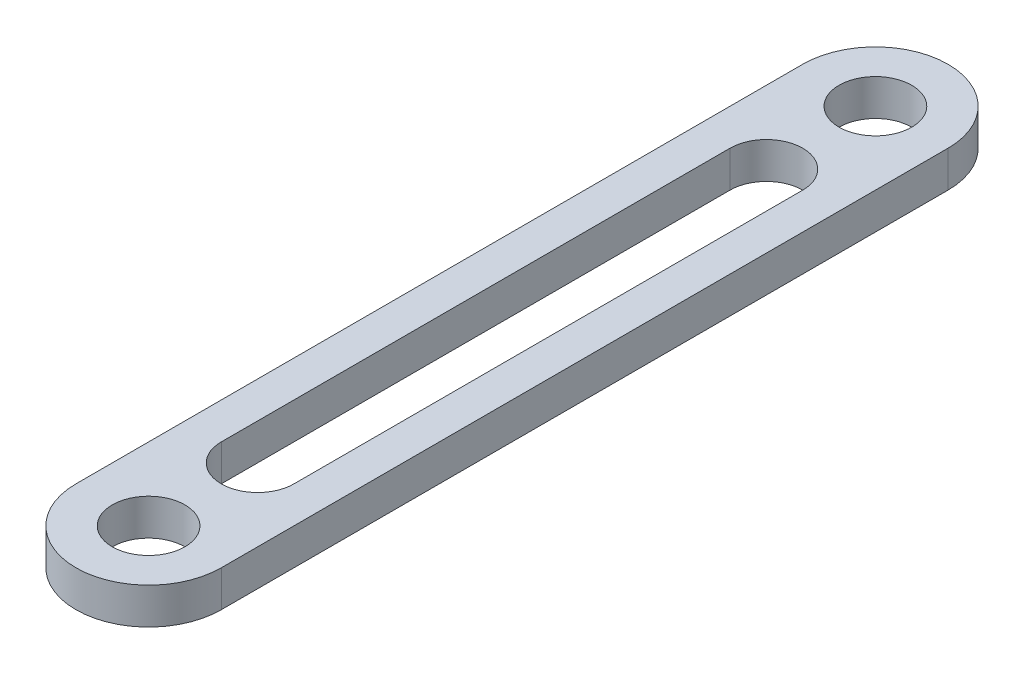
ISO-10303-21;
HEADER;
FILE_DESCRIPTION(('STEP AP214'),'2;1');
FILE_NAME('part.step','',(''),(''),'','','');
FILE_SCHEMA(('AUTOMOTIVE_DESIGN { 1 0 10303 214 1 1 1 1 }'));
ENDSEC;
DATA;
#1=APPLICATION_CONTEXT('core data for automotive mechanical design processes');
#2=APPLICATION_PROTOCOL_DEFINITION('international standard','automotive_design',2000,#1);
#3=PRODUCT_CONTEXT('',#1,'mechanical');
#4=PRODUCT('Part','Part','',(#3));
#5=PRODUCT_RELATED_PRODUCT_CATEGORY('part','',(#4));
#6=PRODUCT_DEFINITION_FORMATION('','',#4);
#7=PRODUCT_DEFINITION_CONTEXT('part definition',#1,'design');
#8=PRODUCT_DEFINITION('design','',#6,#7);
#9=PRODUCT_DEFINITION_SHAPE('','',#8);
#10=(LENGTH_UNIT() NAMED_UNIT(*) SI_UNIT(.MILLI.,.METRE.));
#11=(NAMED_UNIT(*) PLANE_ANGLE_UNIT() SI_UNIT($,.RADIAN.));
#12=(NAMED_UNIT(*) SI_UNIT($,.STERADIAN.) SOLID_ANGLE_UNIT());
#13=UNCERTAINTY_MEASURE_WITH_UNIT(LENGTH_MEASURE(1.E-05),#10,'distance_accuracy_value','');
#14=(GEOMETRIC_REPRESENTATION_CONTEXT(3) GLOBAL_UNCERTAINTY_ASSIGNED_CONTEXT((#13)) GLOBAL_UNIT_ASSIGNED_CONTEXT((#10,
#11,#12)) REPRESENTATION_CONTEXT('',''));
#15=CARTESIAN_POINT('',(0.,0.,0.));
#16=DIRECTION('',(0.,0.,1.));
#17=DIRECTION('',(1.,0.,0.));
#18=AXIS2_PLACEMENT_3D('',#15,#16,#17);
#19=CARTESIAN_POINT('',(0.,5.,0.));
#20=DIRECTION('',(0.,1.,0.));
#21=DIRECTION('',(0.,0.,1.));
#22=AXIS2_PLACEMENT_3D('',#19,#20,#21);
#23=PLANE('',#22);
#24=CARTESIAN_POINT('',(0.,5.,0.));
#25=DIRECTION('',(0.,1.,0.));
#26=DIRECTION('',(0.,0.,1.));
#27=AXIS2_PLACEMENT_3D('',#24,#25,#26);
#28=CIRCLE('',#27,5.);
#29=CARTESIAN_POINT('',(0.,5.,5.));
#30=VERTEX_POINT('',#29);
#31=EDGE_CURVE('E164',#30,#30,#28,.T.);
#32=ORIENTED_EDGE('',*,*,#31,.F.);
#33=EDGE_LOOP('',(#32));
#34=FACE_BOUND('',#33,.T.);
#35=CARTESIAN_POINT('',(0.,5.,0.));
#36=DIRECTION('',(0.,1.,0.));
#37=DIRECTION('',(0.,0.,1.));
#38=AXIS2_PLACEMENT_3D('',#35,#36,#37);
#39=CIRCLE('',#38,10.);
#40=CARTESIAN_POINT('',(-9.99999999999998,5.,0.));
#41=VERTEX_POINT('',#40);
#42=CARTESIAN_POINT('',(9.99999999999999,5.,0.));
#43=VERTEX_POINT('',#42);
#44=EDGE_CURVE('E172',#41,#43,#39,.T.);
#45=ORIENTED_EDGE('',*,*,#44,.T.);
#46=DIRECTION('',(0.,0.,-1.));
#47=VECTOR('',#46,1.);
#48=CARTESIAN_POINT('',(9.99999999999999,5.,0.));
#49=LINE('',#48,#47);
#50=CARTESIAN_POINT('',(10.,5.,-100.));
#51=VERTEX_POINT('',#50);
#52=EDGE_CURVE('E176',#43,#51,#49,.T.);
#53=ORIENTED_EDGE('',*,*,#52,.T.);
#54=CARTESIAN_POINT('',(0.,5.,-100.));
#55=DIRECTION('',(0.,1.,0.));
#56=DIRECTION('',(0.,0.,1.));
#57=AXIS2_PLACEMENT_3D('',#54,#55,#56);
#58=CIRCLE('',#57,10.);
#59=CARTESIAN_POINT('',(-9.99999999999999,5.,-100.));
#60=VERTEX_POINT('',#59);
#61=EDGE_CURVE('E180',#51,#60,#58,.T.);
#62=ORIENTED_EDGE('',*,*,#61,.T.);
#63=DIRECTION('',(0.,0.,1.));
#64=VECTOR('',#63,1.);
#65=CARTESIAN_POINT('',(-9.99999999999998,5.,0.));
#66=LINE('',#65,#64);
#67=EDGE_CURVE('E183',#60,#41,#66,.T.);
#68=ORIENTED_EDGE('',*,*,#67,.T.);
#69=EDGE_LOOP('',(#45,#53,#62,#68));
#70=FACE_BOUND('',#69,.T.);
#71=CARTESIAN_POINT('',(-3.46944695195361E-13,5.,-100.));
#72=DIRECTION('',(0.,1.,0.));
#73=DIRECTION('',(0.,0.,1.));
#74=AXIS2_PLACEMENT_3D('',#71,#72,#73);
#75=CIRCLE('',#74,5.);
#76=CARTESIAN_POINT('',(-3.46944695195361E-13,5.,-95.));
#77=VERTEX_POINT('',#76);
#78=EDGE_CURVE('E156',#77,#77,#75,.T.);
#79=ORIENTED_EDGE('',*,*,#78,.F.);
#80=EDGE_LOOP('',(#79));
#81=FACE_BOUND('',#80,.T.);
#82=DIRECTION('',(0.,0.,1.));
#83=VECTOR('',#82,1.);
#84=CARTESIAN_POINT('',(-4.99999999999999,5.,-85.));
#85=LINE('',#84,#83);
#86=CARTESIAN_POINT('',(-4.99999999999999,5.,-85.));
#87=VERTEX_POINT('',#86);
#88=CARTESIAN_POINT('',(-4.99999999999998,5.,-15.));
#89=VERTEX_POINT('',#88);
#90=EDGE_CURVE('E115',#87,#89,#85,.T.);
#91=ORIENTED_EDGE('',*,*,#90,.F.);
#92=CARTESIAN_POINT('',(0.,5.,-85.));
#93=DIRECTION('',(0.,1.,0.));
#94=DIRECTION('',(0.,0.,1.));
#95=AXIS2_PLACEMENT_3D('',#92,#93,#94);
#96=CIRCLE('',#95,4.99999999999999);
#97=CARTESIAN_POINT('',(4.99999999999998,5.,-85.));
#98=VERTEX_POINT('',#97);
#99=EDGE_CURVE('E106',#98,#87,#96,.T.);
#100=ORIENTED_EDGE('',*,*,#99,.F.);
#101=DIRECTION('',(0.,0.,-1.));
#102=VECTOR('',#101,1.);
#103=CARTESIAN_POINT('',(4.99999999999998,5.,-85.));
#104=LINE('',#103,#102);
#105=CARTESIAN_POINT('',(5.,5.,-15.));
#106=VERTEX_POINT('',#105);
#107=EDGE_CURVE('E134',#106,#98,#104,.T.);
#108=ORIENTED_EDGE('',*,*,#107,.F.);
#109=CARTESIAN_POINT('',(0.,5.,-15.));
#110=DIRECTION('',(0.,1.,0.));
#111=DIRECTION('',(0.,0.,1.));
#112=AXIS2_PLACEMENT_3D('',#109,#110,#111);
#113=CIRCLE('',#112,4.99999999999999);
#114=EDGE_CURVE('E128',#89,#106,#113,.T.);
#115=ORIENTED_EDGE('',*,*,#114,.F.);
#116=EDGE_LOOP('',(#91,#100,#108,#115));
#117=FACE_BOUND('',#116,.T.);
#118=ADVANCED_FACE('F40',(#34,#70,#81,#117),#23,.T.);
#119=CARTESIAN_POINT('',(0.,0.,0.));
#120=DIRECTION('',(0.,1.,0.));
#121=DIRECTION('',(0.,0.,1.));
#122=AXIS2_PLACEMENT_3D('',#119,#120,#121);
#123=PLANE('',#122);
#124=CARTESIAN_POINT('',(-3.46944695195361E-13,0.,-100.));
#125=DIRECTION('',(0.,1.,0.));
#126=DIRECTION('',(0.,0.,1.));
#127=AXIS2_PLACEMENT_3D('',#124,#125,#126);
#128=CIRCLE('',#127,5.);
#129=CARTESIAN_POINT('',(-3.46944695195361E-13,0.,-95.));
#130=VERTEX_POINT('',#129);
#131=EDGE_CURVE('E124',#130,#130,#128,.T.);
#132=ORIENTED_EDGE('',*,*,#131,.T.);
#133=EDGE_LOOP('',(#132));
#134=FACE_BOUND('',#133,.T.);
#135=CARTESIAN_POINT('',(0.,0.,0.));
#136=DIRECTION('',(0.,1.,0.));
#137=DIRECTION('',(0.,0.,1.));
#138=AXIS2_PLACEMENT_3D('',#135,#136,#137);
#139=CIRCLE('',#138,5.);
#140=CARTESIAN_POINT('',(0.,0.,5.));
#141=VERTEX_POINT('',#140);
#142=EDGE_CURVE('E160',#141,#141,#139,.T.);
#143=ORIENTED_EDGE('',*,*,#142,.T.);
#144=EDGE_LOOP('',(#143));
#145=FACE_BOUND('',#144,.T.);
#146=CARTESIAN_POINT('',(0.,0.,0.));
#147=DIRECTION('',(0.,1.,0.));
#148=DIRECTION('',(0.,0.,1.));
#149=AXIS2_PLACEMENT_3D('',#146,#147,#148);
#150=CIRCLE('',#149,10.);
#151=CARTESIAN_POINT('',(-9.99999999999998,0.,0.));
#152=VERTEX_POINT('',#151);
#153=CARTESIAN_POINT('',(9.99999999999999,0.,0.));
#154=VERTEX_POINT('',#153);
#155=EDGE_CURVE('E168',#152,#154,#150,.T.);
#156=ORIENTED_EDGE('',*,*,#155,.F.);
#157=DIRECTION('',(0.,0.,1.));
#158=VECTOR('',#157,1.);
#159=CARTESIAN_POINT('',(-9.99999999999998,0.,0.));
#160=LINE('',#159,#158);
#161=CARTESIAN_POINT('',(-9.99999999999999,0.,-100.));
#162=VERTEX_POINT('',#161);
#163=EDGE_CURVE('E177',#162,#152,#160,.T.);
#164=ORIENTED_EDGE('',*,*,#163,.F.);
#165=CARTESIAN_POINT('',(0.,0.,-100.));
#166=DIRECTION('',(0.,1.,0.));
#167=DIRECTION('',(0.,0.,1.));
#168=AXIS2_PLACEMENT_3D('',#165,#166,#167);
#169=CIRCLE('',#168,10.);
#170=CARTESIAN_POINT('',(10.,0.,-100.));
#171=VERTEX_POINT('',#170);
#172=EDGE_CURVE('E193',#171,#162,#169,.T.);
#173=ORIENTED_EDGE('',*,*,#172,.F.);
#174=DIRECTION('',(0.,0.,-1.));
#175=VECTOR('',#174,1.);
#176=CARTESIAN_POINT('',(9.99999999999999,0.,0.));
#177=LINE('',#176,#175);
#178=EDGE_CURVE('E190',#154,#171,#177,.T.);
#179=ORIENTED_EDGE('',*,*,#178,.F.);
#180=EDGE_LOOP('',(#156,#164,#173,#179));
#181=FACE_BOUND('',#180,.T.);
#182=CARTESIAN_POINT('',(0.,0.,-85.));
#183=DIRECTION('',(0.,1.,0.));
#184=DIRECTION('',(0.,0.,1.));
#185=AXIS2_PLACEMENT_3D('',#182,#183,#184);
#186=CIRCLE('',#185,4.99999999999999);
#187=CARTESIAN_POINT('',(4.99999999999998,0.,-85.));
#188=VERTEX_POINT('',#187);
#189=CARTESIAN_POINT('',(-4.99999999999999,0.,-85.));
#190=VERTEX_POINT('',#189);
#191=EDGE_CURVE('E64',#188,#190,#186,.T.);
#192=ORIENTED_EDGE('',*,*,#191,.T.);
#193=DIRECTION('',(0.,0.,1.));
#194=VECTOR('',#193,1.);
#195=CARTESIAN_POINT('',(-4.99999999999999,0.,-85.));
#196=LINE('',#195,#194);
#197=CARTESIAN_POINT('',(-4.99999999999998,0.,-15.));
#198=VERTEX_POINT('',#197);
#199=EDGE_CURVE('E122',#190,#198,#196,.T.);
#200=ORIENTED_EDGE('',*,*,#199,.T.);
#201=CARTESIAN_POINT('',(0.,0.,-15.));
#202=DIRECTION('',(0.,1.,0.));
#203=DIRECTION('',(0.,0.,1.));
#204=AXIS2_PLACEMENT_3D('',#201,#202,#203);
#205=CIRCLE('',#204,4.99999999999999);
#206=CARTESIAN_POINT('',(5.,0.,-15.));
#207=VERTEX_POINT('',#206);
#208=EDGE_CURVE('E143',#198,#207,#205,.T.);
#209=ORIENTED_EDGE('',*,*,#208,.T.);
#210=DIRECTION('',(0.,0.,-1.));
#211=VECTOR('',#210,1.);
#212=CARTESIAN_POINT('',(4.99999999999998,0.,-85.));
#213=LINE('',#212,#211);
#214=EDGE_CURVE('E116',#207,#188,#213,.T.);
#215=ORIENTED_EDGE('',*,*,#214,.T.);
#216=EDGE_LOOP('',(#192,#200,#209,#215));
#217=FACE_BOUND('',#216,.T.);
#218=ADVANCED_FACE('F218',(#134,#145,#181,#217),#123,.F.);
#219=CARTESIAN_POINT('',(0.,5.,0.));
#220=DIRECTION('',(0.,-1.,0.));
#221=DIRECTION('',(0.,0.,-1.));
#222=AXIS2_PLACEMENT_3D('',#219,#220,#221);
#223=CYLINDRICAL_SURFACE('',#222,10.);
#224=ORIENTED_EDGE('',*,*,#155,.T.);
#225=DIRECTION('',(0.,-1.,0.));
#226=VECTOR('',#225,1.);
#227=CARTESIAN_POINT('',(9.99999999999999,5.,0.));
#228=LINE('',#227,#226);
#229=EDGE_CURVE('E11',#43,#154,#228,.T.);
#230=ORIENTED_EDGE('',*,*,#229,.F.);
#231=ORIENTED_EDGE('',*,*,#44,.F.);
#232=DIRECTION('',(0.,-1.,0.));
#233=VECTOR('',#232,1.);
#234=CARTESIAN_POINT('',(-9.99999999999998,5.,0.));
#235=LINE('',#234,#233);
#236=EDGE_CURVE('E186',#41,#152,#235,.T.);
#237=ORIENTED_EDGE('',*,*,#236,.T.);
#238=EDGE_LOOP('',(#224,#230,#231,#237));
#239=FACE_BOUND('',#238,.T.);
#240=ADVANCED_FACE('F42',(#239),#223,.T.);
#241=CARTESIAN_POINT('',(9.99999999999999,5.,0.));
#242=DIRECTION('',(-1.,0.,0.));
#243=DIRECTION('',(0.,0.,1.));
#244=AXIS2_PLACEMENT_3D('',#241,#242,#243);
#245=PLANE('',#244);
#246=ORIENTED_EDGE('',*,*,#178,.T.);
#247=DIRECTION('',(0.,-1.,0.));
#248=VECTOR('',#247,1.);
#249=CARTESIAN_POINT('',(10.,5.,-100.));
#250=LINE('',#249,#248);
#251=EDGE_CURVE('E49',#51,#171,#250,.T.);
#252=ORIENTED_EDGE('',*,*,#251,.F.);
#253=ORIENTED_EDGE('',*,*,#52,.F.);
#254=ORIENTED_EDGE('',*,*,#229,.T.);
#255=EDGE_LOOP('',(#246,#252,#253,#254));
#256=FACE_BOUND('',#255,.T.);
#257=ADVANCED_FACE('F229',(#256),#245,.F.);
#258=CARTESIAN_POINT('',(0.,5.,-100.));
#259=DIRECTION('',(0.,-1.,0.));
#260=DIRECTION('',(0.,0.,-1.));
#261=AXIS2_PLACEMENT_3D('',#258,#259,#260);
#262=CYLINDRICAL_SURFACE('',#261,10.);
#263=ORIENTED_EDGE('',*,*,#172,.T.);
#264=DIRECTION('',(0.,-1.,0.));
#265=VECTOR('',#264,1.);
#266=CARTESIAN_POINT('',(-9.99999999999999,5.,-100.));
#267=LINE('',#266,#265);
#268=EDGE_CURVE('E201',#60,#162,#267,.T.);
#269=ORIENTED_EDGE('',*,*,#268,.F.);
#270=ORIENTED_EDGE('',*,*,#61,.F.);
#271=ORIENTED_EDGE('',*,*,#251,.T.);
#272=EDGE_LOOP('',(#263,#269,#270,#271));
#273=FACE_BOUND('',#272,.T.);
#274=ADVANCED_FACE('F212',(#273),#262,.T.);
#275=CARTESIAN_POINT('',(-9.99999999999998,5.,0.));
#276=DIRECTION('',(1.,0.,0.));
#277=DIRECTION('',(0.,0.,-1.));
#278=AXIS2_PLACEMENT_3D('',#275,#276,#277);
#279=PLANE('',#278);
#280=ORIENTED_EDGE('',*,*,#163,.T.);
#281=ORIENTED_EDGE('',*,*,#236,.F.);
#282=ORIENTED_EDGE('',*,*,#67,.F.);
#283=ORIENTED_EDGE('',*,*,#268,.T.);
#284=EDGE_LOOP('',(#280,#281,#282,#283));
#285=FACE_BOUND('',#284,.T.);
#286=ADVANCED_FACE('F222',(#285),#279,.F.);
#287=CARTESIAN_POINT('',(0.,5.,0.));
#288=DIRECTION('',(0.,-1.,0.));
#289=DIRECTION('',(0.,0.,-1.));
#290=AXIS2_PLACEMENT_3D('',#287,#288,#289);
#291=CYLINDRICAL_SURFACE('',#290,5.);
#292=ORIENTED_EDGE('',*,*,#31,.T.);
#293=EDGE_LOOP('',(#292));
#294=FACE_BOUND('',#293,.T.);
#295=ORIENTED_EDGE('',*,*,#142,.F.);
#296=EDGE_LOOP('',(#295));
#297=FACE_BOUND('',#296,.T.);
#298=ADVANCED_FACE('F246',(#294,#297),#291,.F.);
#299=CARTESIAN_POINT('',(-3.46944695195361E-13,5.,-100.));
#300=DIRECTION('',(0.,-1.,0.));
#301=DIRECTION('',(0.,0.,-1.));
#302=AXIS2_PLACEMENT_3D('',#299,#300,#301);
#303=CYLINDRICAL_SURFACE('',#302,5.);
#304=ORIENTED_EDGE('',*,*,#78,.T.);
#305=EDGE_LOOP('',(#304));
#306=FACE_BOUND('',#305,.T.);
#307=ORIENTED_EDGE('',*,*,#131,.F.);
#308=EDGE_LOOP('',(#307));
#309=FACE_BOUND('',#308,.T.);
#310=ADVANCED_FACE('F253',(#306,#309),#303,.F.);
#311=CARTESIAN_POINT('',(0.,5.,-85.));
#312=DIRECTION('',(0.,-1.,0.));
#313=DIRECTION('',(0.,0.,-1.));
#314=AXIS2_PLACEMENT_3D('',#311,#312,#313);
#315=CYLINDRICAL_SURFACE('',#314,4.99999999999999);
#316=ORIENTED_EDGE('',*,*,#191,.F.);
#317=DIRECTION('',(0.,-1.,0.));
#318=VECTOR('',#317,1.);
#319=CARTESIAN_POINT('',(4.99999999999998,5.,-85.));
#320=LINE('',#319,#318);
#321=EDGE_CURVE('E110',#98,#188,#320,.T.);
#322=ORIENTED_EDGE('',*,*,#321,.F.);
#323=ORIENTED_EDGE('',*,*,#99,.T.);
#324=DIRECTION('',(0.,-1.,0.));
#325=VECTOR('',#324,1.);
#326=CARTESIAN_POINT('',(-4.99999999999999,5.,-85.));
#327=LINE('',#326,#325);
#328=EDGE_CURVE('E109',#87,#190,#327,.T.);
#329=ORIENTED_EDGE('',*,*,#328,.T.);
#330=EDGE_LOOP('',(#316,#322,#323,#329));
#331=FACE_BOUND('',#330,.T.);
#332=ADVANCED_FACE('F108',(#331),#315,.F.);
#333=CARTESIAN_POINT('',(-4.99999999999999,5.,-85.));
#334=DIRECTION('',(1.,0.,0.));
#335=DIRECTION('',(0.,0.,-1.));
#336=AXIS2_PLACEMENT_3D('',#333,#334,#335);
#337=PLANE('',#336);
#338=ORIENTED_EDGE('',*,*,#199,.F.);
#339=ORIENTED_EDGE('',*,*,#328,.F.);
#340=ORIENTED_EDGE('',*,*,#90,.T.);
#341=DIRECTION('',(0.,-1.,0.));
#342=VECTOR('',#341,1.);
#343=CARTESIAN_POINT('',(-4.99999999999998,5.,-15.));
#344=LINE('',#343,#342);
#345=EDGE_CURVE('E125',#89,#198,#344,.T.);
#346=ORIENTED_EDGE('',*,*,#345,.T.);
#347=EDGE_LOOP('',(#338,#339,#340,#346));
#348=FACE_BOUND('',#347,.T.);
#349=ADVANCED_FACE('F119',(#348),#337,.T.);
#350=CARTESIAN_POINT('',(0.,5.,-15.));
#351=DIRECTION('',(0.,-1.,0.));
#352=DIRECTION('',(0.,0.,-1.));
#353=AXIS2_PLACEMENT_3D('',#350,#351,#352);
#354=CYLINDRICAL_SURFACE('',#353,4.99999999999999);
#355=ORIENTED_EDGE('',*,*,#208,.F.);
#356=ORIENTED_EDGE('',*,*,#345,.F.);
#357=ORIENTED_EDGE('',*,*,#114,.T.);
#358=DIRECTION('',(0.,-1.,0.));
#359=VECTOR('',#358,1.);
#360=CARTESIAN_POINT('',(5.,5.,-15.));
#361=LINE('',#360,#359);
#362=EDGE_CURVE('E56',#106,#207,#361,.T.);
#363=ORIENTED_EDGE('',*,*,#362,.T.);
#364=EDGE_LOOP('',(#355,#356,#357,#363));
#365=FACE_BOUND('',#364,.T.);
#366=ADVANCED_FACE('F270',(#365),#354,.F.);
#367=CARTESIAN_POINT('',(4.99999999999998,5.,-85.));
#368=DIRECTION('',(-1.,0.,0.));
#369=DIRECTION('',(0.,0.,1.));
#370=AXIS2_PLACEMENT_3D('',#367,#368,#369);
#371=PLANE('',#370);
#372=ORIENTED_EDGE('',*,*,#214,.F.);
#373=ORIENTED_EDGE('',*,*,#362,.F.);
#374=ORIENTED_EDGE('',*,*,#107,.T.);
#375=ORIENTED_EDGE('',*,*,#321,.T.);
#376=EDGE_LOOP('',(#372,#373,#374,#375));
#377=FACE_BOUND('',#376,.T.);
#378=ADVANCED_FACE('F273',(#377),#371,.T.);
#379=CLOSED_SHELL('',(#118,#218,#240,#257,#274,#286,#298,#310,#332,#349,#366,#378));
#380=MANIFOLD_SOLID_BREP('B2',#379);
#381=ADVANCED_BREP_SHAPE_REPRESENTATION('',(#18,#380),#14);
#382=SHAPE_DEFINITION_REPRESENTATION(#9,#381);
ENDSEC;
END-ISO-10303-21;
